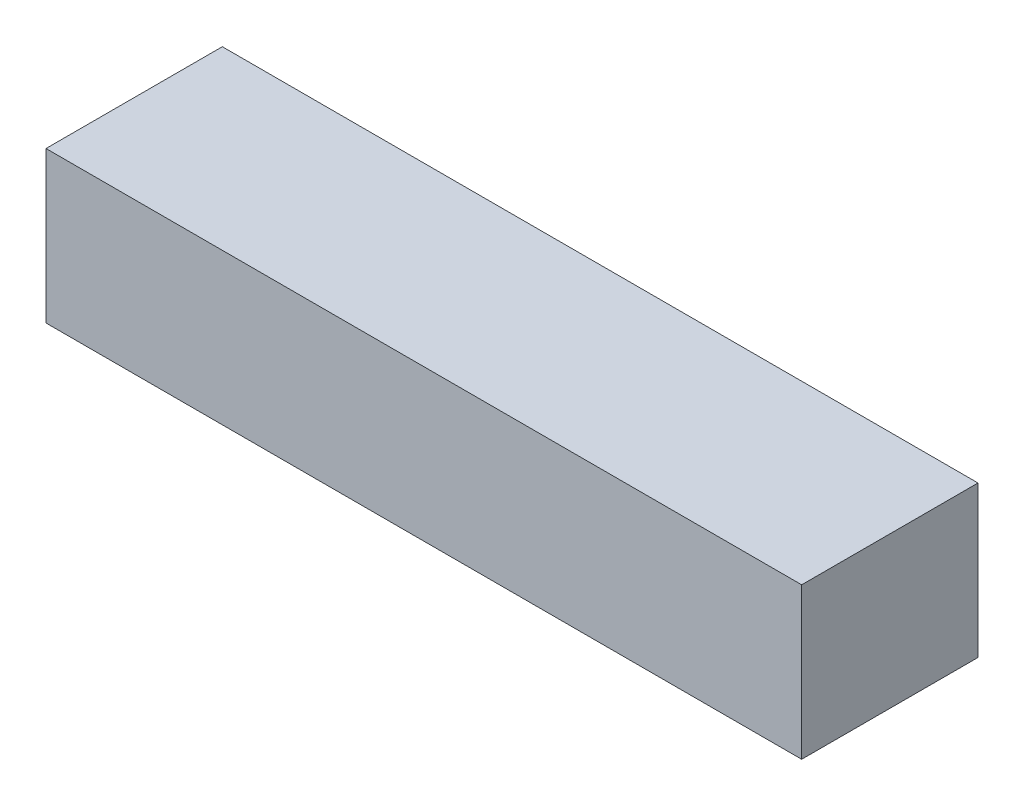
ISO-10303-21;
HEADER;
FILE_DESCRIPTION(('STEP AP214'),'2;1');
FILE_NAME('part.step','',(''),(''),'','','');
FILE_SCHEMA(('AUTOMOTIVE_DESIGN { 1 0 10303 214 1 1 1 1 }'));
ENDSEC;
DATA;
#1=APPLICATION_CONTEXT('core data for automotive mechanical design processes');
#2=APPLICATION_PROTOCOL_DEFINITION('international standard','automotive_design',2000,#1);
#3=PRODUCT_CONTEXT('',#1,'mechanical');
#4=PRODUCT('Part','Part','',(#3));
#5=PRODUCT_RELATED_PRODUCT_CATEGORY('part','',(#4));
#6=PRODUCT_DEFINITION_FORMATION('','',#4);
#7=PRODUCT_DEFINITION_CONTEXT('part definition',#1,'design');
#8=PRODUCT_DEFINITION('design','',#6,#7);
#9=PRODUCT_DEFINITION_SHAPE('','',#8);
#10=(LENGTH_UNIT() NAMED_UNIT(*) SI_UNIT(.MILLI.,.METRE.));
#11=(NAMED_UNIT(*) PLANE_ANGLE_UNIT() SI_UNIT($,.RADIAN.));
#12=(NAMED_UNIT(*) SI_UNIT($,.STERADIAN.) SOLID_ANGLE_UNIT());
#13=UNCERTAINTY_MEASURE_WITH_UNIT(LENGTH_MEASURE(1.E-05),#10,'distance_accuracy_value','');
#14=(GEOMETRIC_REPRESENTATION_CONTEXT(3) GLOBAL_UNCERTAINTY_ASSIGNED_CONTEXT((#13)) GLOBAL_UNIT_ASSIGNED_CONTEXT((#10,
#11,#12)) REPRESENTATION_CONTEXT('',''));
#15=CARTESIAN_POINT('',(0.,0.,0.));
#16=DIRECTION('',(0.,0.,1.));
#17=DIRECTION('',(1.,0.,0.));
#18=AXIS2_PLACEMENT_3D('',#15,#16,#17);
#19=CARTESIAN_POINT('',(0.,6.,0.));
#20=DIRECTION('',(1.,0.,0.));
#21=DIRECTION('',(0.,0.,-1.));
#22=AXIS2_PLACEMENT_3D('',#19,#20,#21);
#23=PLANE('',#22);
#24=DIRECTION('',(0.,0.,1.));
#25=VECTOR('',#24,1.);
#26=CARTESIAN_POINT('',(0.,0.,0.));
#27=LINE('',#26,#25);
#28=CARTESIAN_POINT('',(0.,0.,-7.));
#29=VERTEX_POINT('',#28);
#30=CARTESIAN_POINT('',(0.,0.,0.));
#31=VERTEX_POINT('',#30);
#32=EDGE_CURVE('E96',#29,#31,#27,.T.);
#33=ORIENTED_EDGE('',*,*,#32,.T.);
#34=DIRECTION('',(0.,-1.,0.));
#35=VECTOR('',#34,1.);
#36=CARTESIAN_POINT('',(0.,6.,0.));
#37=LINE('',#36,#35);
#38=CARTESIAN_POINT('',(0.,6.,0.));
#39=VERTEX_POINT('',#38);
#40=EDGE_CURVE('E11',#39,#31,#37,.T.);
#41=ORIENTED_EDGE('',*,*,#40,.F.);
#42=DIRECTION('',(0.,0.,1.));
#43=VECTOR('',#42,1.);
#44=CARTESIAN_POINT('',(0.,6.,0.));
#45=LINE('',#44,#43);
#46=CARTESIAN_POINT('',(0.,6.,-7.));
#47=VERTEX_POINT('',#46);
#48=EDGE_CURVE('E84',#47,#39,#45,.T.);
#49=ORIENTED_EDGE('',*,*,#48,.F.);
#50=DIRECTION('',(0.,-1.,0.));
#51=VECTOR('',#50,1.);
#52=CARTESIAN_POINT('',(0.,6.,-7.));
#53=LINE('',#52,#51);
#54=EDGE_CURVE('E92',#47,#29,#53,.T.);
#55=ORIENTED_EDGE('',*,*,#54,.T.);
#56=EDGE_LOOP('',(#33,#41,#49,#55));
#57=FACE_BOUND('',#56,.T.);
#58=ADVANCED_FACE('F33',(#57),#23,.F.);
#59=CARTESIAN_POINT('',(0.,6.,0.));
#60=DIRECTION('',(0.,0.,-1.));
#61=DIRECTION('',(-1.,0.,0.));
#62=AXIS2_PLACEMENT_3D('',#59,#60,#61);
#63=PLANE('',#62);
#64=DIRECTION('',(1.,0.,0.));
#65=VECTOR('',#64,1.);
#66=CARTESIAN_POINT('',(0.,0.,0.));
#67=LINE('',#66,#65);
#68=CARTESIAN_POINT('',(30.,0.,0.));
#69=VERTEX_POINT('',#68);
#70=EDGE_CURVE('E88',#31,#69,#67,.T.);
#71=ORIENTED_EDGE('',*,*,#70,.T.);
#72=DIRECTION('',(0.,-1.,0.));
#73=VECTOR('',#72,1.);
#74=CARTESIAN_POINT('',(30.,6.,0.));
#75=LINE('',#74,#73);
#76=CARTESIAN_POINT('',(30.,6.,0.));
#77=VERTEX_POINT('',#76);
#78=EDGE_CURVE('E41',#77,#69,#75,.T.);
#79=ORIENTED_EDGE('',*,*,#78,.F.);
#80=DIRECTION('',(1.,0.,0.));
#81=VECTOR('',#80,1.);
#82=CARTESIAN_POINT('',(0.,6.,0.));
#83=LINE('',#82,#81);
#84=EDGE_CURVE('E79',#39,#77,#83,.T.);
#85=ORIENTED_EDGE('',*,*,#84,.F.);
#86=ORIENTED_EDGE('',*,*,#40,.T.);
#87=EDGE_LOOP('',(#71,#79,#85,#86));
#88=FACE_BOUND('',#87,.T.);
#89=ADVANCED_FACE('F87',(#88),#63,.F.);
#90=CARTESIAN_POINT('',(30.,6.,0.));
#91=DIRECTION('',(-1.,0.,0.));
#92=DIRECTION('',(0.,0.,1.));
#93=AXIS2_PLACEMENT_3D('',#90,#91,#92);
#94=PLANE('',#93);
#95=DIRECTION('',(0.,0.,-1.));
#96=VECTOR('',#95,1.);
#97=CARTESIAN_POINT('',(30.,0.,0.));
#98=LINE('',#97,#96);
#99=CARTESIAN_POINT('',(30.,0.,-7.));
#100=VERTEX_POINT('',#99);
#101=EDGE_CURVE('E66',#69,#100,#98,.T.);
#102=ORIENTED_EDGE('',*,*,#101,.T.);
#103=DIRECTION('',(0.,-1.,0.));
#104=VECTOR('',#103,1.);
#105=CARTESIAN_POINT('',(30.,6.,-7.));
#106=LINE('',#105,#104);
#107=CARTESIAN_POINT('',(30.,6.,-7.));
#108=VERTEX_POINT('',#107);
#109=EDGE_CURVE('E89',#108,#100,#106,.T.);
#110=ORIENTED_EDGE('',*,*,#109,.F.);
#111=DIRECTION('',(0.,0.,-1.));
#112=VECTOR('',#111,1.);
#113=CARTESIAN_POINT('',(30.,6.,0.));
#114=LINE('',#113,#112);
#115=EDGE_CURVE('E82',#77,#108,#114,.T.);
#116=ORIENTED_EDGE('',*,*,#115,.F.);
#117=ORIENTED_EDGE('',*,*,#78,.T.);
#118=EDGE_LOOP('',(#102,#110,#116,#117));
#119=FACE_BOUND('',#118,.T.);
#120=ADVANCED_FACE('F90',(#119),#94,.F.);
#121=CARTESIAN_POINT('',(0.,6.,-7.));
#122=DIRECTION('',(0.,0.,1.));
#123=DIRECTION('',(1.,0.,0.));
#124=AXIS2_PLACEMENT_3D('',#121,#122,#123);
#125=PLANE('',#124);
#126=DIRECTION('',(-1.,0.,0.));
#127=VECTOR('',#126,1.);
#128=CARTESIAN_POINT('',(0.,0.,-7.));
#129=LINE('',#128,#127);
#130=EDGE_CURVE('E72',#100,#29,#129,.T.);
#131=ORIENTED_EDGE('',*,*,#130,.T.);
#132=ORIENTED_EDGE('',*,*,#54,.F.);
#133=DIRECTION('',(-1.,0.,0.));
#134=VECTOR('',#133,1.);
#135=CARTESIAN_POINT('',(0.,6.,-7.));
#136=LINE('',#135,#134);
#137=EDGE_CURVE('E49',#108,#47,#136,.T.);
#138=ORIENTED_EDGE('',*,*,#137,.F.);
#139=ORIENTED_EDGE('',*,*,#109,.T.);
#140=EDGE_LOOP('',(#131,#132,#138,#139));
#141=FACE_BOUND('',#140,.T.);
#142=ADVANCED_FACE('F103',(#141),#125,.F.);
#143=CARTESIAN_POINT('',(0.,6.,0.));
#144=DIRECTION('',(0.,-1.,0.));
#145=DIRECTION('',(0.,0.,-1.));
#146=AXIS2_PLACEMENT_3D('',#143,#144,#145);
#147=PLANE('',#146);
#148=ORIENTED_EDGE('',*,*,#48,.T.);
#149=ORIENTED_EDGE('',*,*,#84,.T.);
#150=ORIENTED_EDGE('',*,*,#115,.T.);
#151=ORIENTED_EDGE('',*,*,#137,.T.);
#152=EDGE_LOOP('',(#148,#149,#150,#151));
#153=FACE_BOUND('',#152,.T.);
#154=ADVANCED_FACE('F80',(#153),#147,.F.);
#155=CARTESIAN_POINT('',(0.,0.,0.));
#156=DIRECTION('',(0.,-1.,0.));
#157=DIRECTION('',(0.,0.,-1.));
#158=AXIS2_PLACEMENT_3D('',#155,#156,#157);
#159=PLANE('',#158);
#160=ORIENTED_EDGE('',*,*,#32,.F.);
#161=ORIENTED_EDGE('',*,*,#130,.F.);
#162=ORIENTED_EDGE('',*,*,#101,.F.);
#163=ORIENTED_EDGE('',*,*,#70,.F.);
#164=EDGE_LOOP('',(#160,#161,#162,#163));
#165=FACE_BOUND('',#164,.T.);
#166=ADVANCED_FACE('F106',(#165),#159,.T.);
#167=CLOSED_SHELL('',(#58,#89,#120,#142,#154,#166));
#168=MANIFOLD_SOLID_BREP('B2',#167);
#169=ADVANCED_BREP_SHAPE_REPRESENTATION('',(#18,#168),#14);
#170=SHAPE_DEFINITION_REPRESENTATION(#9,#169);
ENDSEC;
END-ISO-10303-21;
